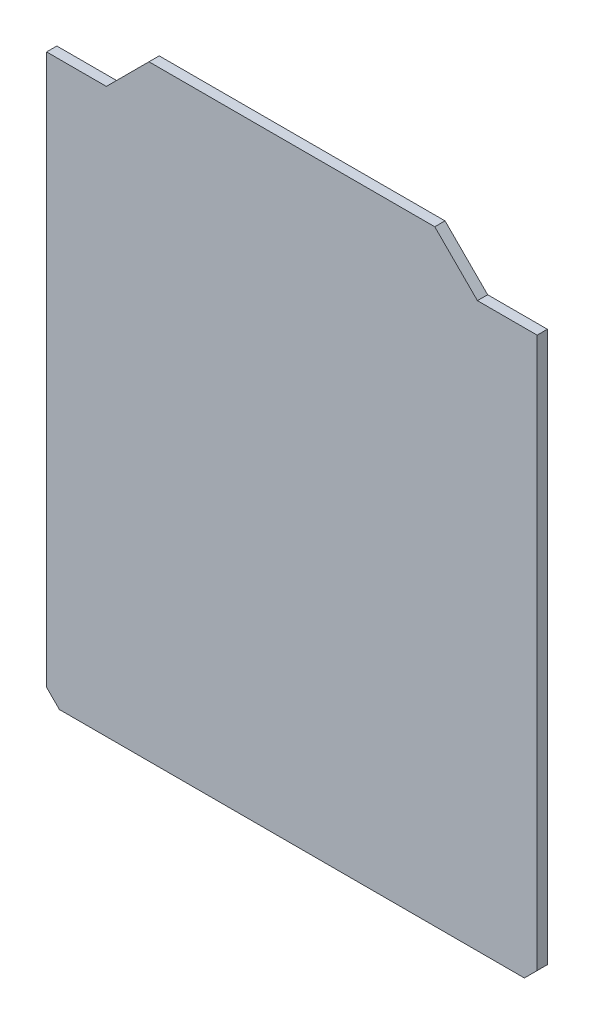
ISO-10303-21;
HEADER;
FILE_DESCRIPTION(('STEP AP214'),'2;1');
FILE_NAME('part.step','',(''),(''),'','','');
FILE_SCHEMA(('AUTOMOTIVE_DESIGN { 1 0 10303 214 1 1 1 1 }'));
ENDSEC;
DATA;
#1=APPLICATION_CONTEXT('core data for automotive mechanical design processes');
#2=APPLICATION_PROTOCOL_DEFINITION('international standard','automotive_design',2000,#1);
#3=PRODUCT_CONTEXT('',#1,'mechanical');
#4=PRODUCT('Part','Part','',(#3));
#5=PRODUCT_RELATED_PRODUCT_CATEGORY('part','',(#4));
#6=PRODUCT_DEFINITION_FORMATION('','',#4);
#7=PRODUCT_DEFINITION_CONTEXT('part definition',#1,'design');
#8=PRODUCT_DEFINITION('design','',#6,#7);
#9=PRODUCT_DEFINITION_SHAPE('','',#8);
#10=(LENGTH_UNIT() NAMED_UNIT(*) SI_UNIT(.MILLI.,.METRE.));
#11=(NAMED_UNIT(*) PLANE_ANGLE_UNIT() SI_UNIT($,.RADIAN.));
#12=(NAMED_UNIT(*) SI_UNIT($,.STERADIAN.) SOLID_ANGLE_UNIT());
#13=UNCERTAINTY_MEASURE_WITH_UNIT(LENGTH_MEASURE(1.E-05),#10,'distance_accuracy_value','');
#14=(GEOMETRIC_REPRESENTATION_CONTEXT(3) GLOBAL_UNCERTAINTY_ASSIGNED_CONTEXT((#13)) GLOBAL_UNIT_ASSIGNED_CONTEXT((#10,
#11,#12)) REPRESENTATION_CONTEXT('',''));
#15=CARTESIAN_POINT('',(0.,0.,0.));
#16=DIRECTION('',(0.,0.,1.));
#17=DIRECTION('',(1.,0.,0.));
#18=AXIS2_PLACEMENT_3D('',#15,#16,#17);
#19=CARTESIAN_POINT('',(29.2004047680435,40.5933845903599,1.2));
#20=DIRECTION('',(-1.,0.,0.));
#21=DIRECTION('',(0.,-1.,0.));
#22=AXIS2_PLACEMENT_3D('',#19,#20,#21);
#23=PLANE('',#22);
#24=DIRECTION('',(0.,1.,0.));
#25=VECTOR('',#24,1.);
#26=CARTESIAN_POINT('',(29.2004047680435,40.5933845903599,1.2));
#27=LINE('',#26,#25);
#28=CARTESIAN_POINT('',(29.2004047680435,-23.914429894717,1.2));
#29=VERTEX_POINT('',#28);
#30=CARTESIAN_POINT('',(29.2004047680435,40.5933845903599,1.2));
#31=VERTEX_POINT('',#30);
#32=EDGE_CURVE('E115',#29,#31,#27,.T.);
#33=ORIENTED_EDGE('',*,*,#32,.F.);
#34=DIRECTION('',(0.,0.,-1.));
#35=VECTOR('',#34,1.);
#36=CARTESIAN_POINT('',(29.2004047680435,-23.914429894717,1.2));
#37=LINE('',#36,#35);
#38=CARTESIAN_POINT('',(29.2004047680435,-23.914429894717,0.));
#39=VERTEX_POINT('',#38);
#40=EDGE_CURVE('E11',#29,#39,#37,.T.);
#41=ORIENTED_EDGE('',*,*,#40,.T.);
#42=DIRECTION('',(0.,1.,0.));
#43=VECTOR('',#42,1.);
#44=CARTESIAN_POINT('',(29.2004047680435,40.5933845903599,0.));
#45=LINE('',#44,#43);
#46=CARTESIAN_POINT('',(29.2004047680435,40.5933845903599,0.));
#47=VERTEX_POINT('',#46);
#48=EDGE_CURVE('E135',#39,#47,#45,.T.);
#49=ORIENTED_EDGE('',*,*,#48,.T.);
#50=DIRECTION('',(0.,0.,-1.));
#51=VECTOR('',#50,1.);
#52=CARTESIAN_POINT('',(29.2004047680435,40.5933845903599,1.2));
#53=LINE('',#52,#51);
#54=EDGE_CURVE('E128',#31,#47,#53,.T.);
#55=ORIENTED_EDGE('',*,*,#54,.F.);
#56=EDGE_LOOP('',(#33,#41,#49,#55));
#57=FACE_BOUND('',#56,.T.);
#58=ADVANCED_FACE('F37',(#57),#23,.F.);
#59=CARTESIAN_POINT('',(22.2004047680435,40.5933845903599,1.2));
#60=DIRECTION('',(0.,-1.,0.));
#61=DIRECTION('',(0.,0.,-1.));
#62=AXIS2_PLACEMENT_3D('',#59,#60,#61);
#63=PLANE('',#62);
#64=DIRECTION('',(-1.,0.,0.));
#65=VECTOR('',#64,1.);
#66=CARTESIAN_POINT('',(22.2004047680435,40.5933845903599,0.));
#67=LINE('',#66,#65);
#68=CARTESIAN_POINT('',(22.2004047680435,40.5933845903599,0.));
#69=VERTEX_POINT('',#68);
#70=EDGE_CURVE('E201',#47,#69,#67,.T.);
#71=ORIENTED_EDGE('',*,*,#70,.T.);
#72=DIRECTION('',(0.,0.,-1.));
#73=VECTOR('',#72,1.);
#74=CARTESIAN_POINT('',(22.2004047680435,40.5933845903599,1.2));
#75=LINE('',#74,#73);
#76=CARTESIAN_POINT('',(22.2004047680435,40.5933845903599,1.2));
#77=VERTEX_POINT('',#76);
#78=EDGE_CURVE('E130',#77,#69,#75,.T.);
#79=ORIENTED_EDGE('',*,*,#78,.F.);
#80=DIRECTION('',(-1.,0.,0.));
#81=VECTOR('',#80,1.);
#82=CARTESIAN_POINT('',(22.2004047680435,40.5933845903599,1.2));
#83=LINE('',#82,#81);
#84=EDGE_CURVE('E118',#31,#77,#83,.T.);
#85=ORIENTED_EDGE('',*,*,#84,.F.);
#86=ORIENTED_EDGE('',*,*,#54,.T.);
#87=EDGE_LOOP('',(#71,#79,#85,#86));
#88=FACE_BOUND('',#87,.T.);
#89=ADVANCED_FACE('F127',(#88),#63,.F.);
#90=CARTESIAN_POINT('',(17.2004047680435,45.5933845903599,1.2));
#91=DIRECTION('',(-0.707106781186546,-0.707106781186549,0.));
#92=DIRECTION('',(0.707106781186549,-0.707106781186546,0.));
#93=AXIS2_PLACEMENT_3D('',#90,#91,#92);
#94=PLANE('',#93);
#95=DIRECTION('',(-0.707106781186549,0.707106781186546,0.));
#96=VECTOR('',#95,1.);
#97=CARTESIAN_POINT('',(17.2004047680435,45.5933845903599,0.));
#98=LINE('',#97,#96);
#99=CARTESIAN_POINT('',(17.2004047680435,45.5933845903599,0.));
#100=VERTEX_POINT('',#99);
#101=EDGE_CURVE('E199',#69,#100,#98,.T.);
#102=ORIENTED_EDGE('',*,*,#101,.T.);
#103=DIRECTION('',(0.,0.,-1.));
#104=VECTOR('',#103,1.);
#105=CARTESIAN_POINT('',(17.2004047680435,45.5933845903599,1.2));
#106=LINE('',#105,#104);
#107=CARTESIAN_POINT('',(17.2004047680435,45.5933845903599,1.2));
#108=VERTEX_POINT('',#107);
#109=EDGE_CURVE('E141',#108,#100,#106,.T.);
#110=ORIENTED_EDGE('',*,*,#109,.F.);
#111=DIRECTION('',(-0.707106781186549,0.707106781186546,0.));
#112=VECTOR('',#111,1.);
#113=CARTESIAN_POINT('',(17.2004047680435,45.5933845903599,1.2));
#114=LINE('',#113,#112);
#115=EDGE_CURVE('E132',#77,#108,#114,.T.);
#116=ORIENTED_EDGE('',*,*,#115,.F.);
#117=ORIENTED_EDGE('',*,*,#78,.T.);
#118=EDGE_LOOP('',(#102,#110,#116,#117));
#119=FACE_BOUND('',#118,.T.);
#120=ADVANCED_FACE('F212',(#119),#94,.F.);
#121=CARTESIAN_POINT('',(17.2004047680435,45.5933845903599,1.2));
#122=DIRECTION('',(0.,-1.,0.));
#123=DIRECTION('',(1.,0.,0.));
#124=AXIS2_PLACEMENT_3D('',#121,#122,#123);
#125=PLANE('',#124);
#126=DIRECTION('',(-1.,0.,0.));
#127=VECTOR('',#126,1.);
#128=CARTESIAN_POINT('',(17.2004047680435,45.5933845903599,0.));
#129=LINE('',#128,#127);
#130=CARTESIAN_POINT('',(-16.2995952319565,45.5933845903599,0.));
#131=VERTEX_POINT('',#130);
#132=EDGE_CURVE('E194',#100,#131,#129,.T.);
#133=ORIENTED_EDGE('',*,*,#132,.T.);
#134=DIRECTION('',(0.,0.,-1.));
#135=VECTOR('',#134,1.);
#136=CARTESIAN_POINT('',(-16.2995952319565,45.5933845903599,1.2));
#137=LINE('',#136,#135);
#138=CARTESIAN_POINT('',(-16.2995952319565,45.5933845903599,1.2));
#139=VERTEX_POINT('',#138);
#140=EDGE_CURVE('E185',#139,#131,#137,.T.);
#141=ORIENTED_EDGE('',*,*,#140,.F.);
#142=DIRECTION('',(-1.,0.,0.));
#143=VECTOR('',#142,1.);
#144=CARTESIAN_POINT('',(17.2004047680435,45.5933845903599,1.2));
#145=LINE('',#144,#143);
#146=EDGE_CURVE('E195',#108,#139,#145,.T.);
#147=ORIENTED_EDGE('',*,*,#146,.F.);
#148=ORIENTED_EDGE('',*,*,#109,.T.);
#149=EDGE_LOOP('',(#133,#141,#147,#148));
#150=FACE_BOUND('',#149,.T.);
#151=ADVANCED_FACE('F192',(#150),#125,.F.);
#152=CARTESIAN_POINT('',(-21.2995952319565,40.5933845903599,1.2));
#153=DIRECTION('',(0.707106781186549,-0.707106781186546,0.));
#154=DIRECTION('',(0.707106781186546,0.707106781186549,0.));
#155=AXIS2_PLACEMENT_3D('',#152,#153,#154);
#156=PLANE('',#155);
#157=DIRECTION('',(-0.707106781186546,-0.707106781186549,0.));
#158=VECTOR('',#157,1.);
#159=CARTESIAN_POINT('',(-21.2995952319565,40.5933845903599,0.));
#160=LINE('',#159,#158);
#161=CARTESIAN_POINT('',(-21.2995952319565,40.5933845903599,0.));
#162=VERTEX_POINT('',#161);
#163=EDGE_CURVE('E177',#131,#162,#160,.T.);
#164=ORIENTED_EDGE('',*,*,#163,.T.);
#165=DIRECTION('',(0.,0.,-1.));
#166=VECTOR('',#165,1.);
#167=CARTESIAN_POINT('',(-21.2995952319565,40.5933845903599,1.2));
#168=LINE('',#167,#166);
#169=CARTESIAN_POINT('',(-21.2995952319565,40.5933845903599,1.2));
#170=VERTEX_POINT('',#169);
#171=EDGE_CURVE('E182',#170,#162,#168,.T.);
#172=ORIENTED_EDGE('',*,*,#171,.F.);
#173=DIRECTION('',(-0.707106781186546,-0.707106781186549,0.));
#174=VECTOR('',#173,1.);
#175=CARTESIAN_POINT('',(-21.2995952319565,40.5933845903599,1.2));
#176=LINE('',#175,#174);
#177=EDGE_CURVE('E209',#139,#170,#176,.T.);
#178=ORIENTED_EDGE('',*,*,#177,.F.);
#179=ORIENTED_EDGE('',*,*,#140,.T.);
#180=EDGE_LOOP('',(#164,#172,#178,#179));
#181=FACE_BOUND('',#180,.T.);
#182=ADVANCED_FACE('F219',(#181),#156,.F.);
#183=CARTESIAN_POINT('',(-28.2995952319565,40.5933845903599,1.2));
#184=DIRECTION('',(0.,-1.,0.));
#185=DIRECTION('',(0.,0.,-1.));
#186=AXIS2_PLACEMENT_3D('',#183,#184,#185);
#187=PLANE('',#186);
#188=DIRECTION('',(-1.,0.,0.));
#189=VECTOR('',#188,1.);
#190=CARTESIAN_POINT('',(-28.2995952319565,40.5933845903599,0.));
#191=LINE('',#190,#189);
#192=CARTESIAN_POINT('',(-28.2995952319565,40.5933845903599,0.));
#193=VERTEX_POINT('',#192);
#194=EDGE_CURVE('E174',#162,#193,#191,.T.);
#195=ORIENTED_EDGE('',*,*,#194,.T.);
#196=DIRECTION('',(0.,0.,-1.));
#197=VECTOR('',#196,1.);
#198=CARTESIAN_POINT('',(-28.2995952319565,40.5933845903599,1.2));
#199=LINE('',#198,#197);
#200=CARTESIAN_POINT('',(-28.2995952319565,40.5933845903599,1.2));
#201=VERTEX_POINT('',#200);
#202=EDGE_CURVE('E163',#201,#193,#199,.T.);
#203=ORIENTED_EDGE('',*,*,#202,.F.);
#204=DIRECTION('',(-1.,0.,0.));
#205=VECTOR('',#204,1.);
#206=CARTESIAN_POINT('',(-28.2995952319565,40.5933845903599,1.2));
#207=LINE('',#206,#205);
#208=EDGE_CURVE('E207',#170,#201,#207,.T.);
#209=ORIENTED_EDGE('',*,*,#208,.F.);
#210=ORIENTED_EDGE('',*,*,#171,.T.);
#211=EDGE_LOOP('',(#195,#203,#209,#210));
#212=FACE_BOUND('',#211,.T.);
#213=ADVANCED_FACE('F245',(#212),#187,.F.);
#214=CARTESIAN_POINT('',(-28.2995952319565,40.5933845903599,1.2));
#215=DIRECTION('',(1.,0.,0.));
#216=DIRECTION('',(0.,1.,0.));
#217=AXIS2_PLACEMENT_3D('',#214,#215,#216);
#218=PLANE('',#217);
#219=DIRECTION('',(0.,-1.,0.));
#220=VECTOR('',#219,1.);
#221=CARTESIAN_POINT('',(-28.2995952319565,40.5933845903599,0.));
#222=LINE('',#221,#220);
#223=CARTESIAN_POINT('',(-28.2995952319565,-23.914429894717,0.));
#224=VERTEX_POINT('',#223);
#225=EDGE_CURVE('E170',#193,#224,#222,.T.);
#226=ORIENTED_EDGE('',*,*,#225,.T.);
#227=DIRECTION('',(0.,0.,1.));
#228=VECTOR('',#227,1.);
#229=CARTESIAN_POINT('',(-28.2995952319565,-23.914429894717,1.2));
#230=LINE('',#229,#228);
#231=CARTESIAN_POINT('',(-28.2995952319565,-23.914429894717,1.2));
#232=VERTEX_POINT('',#231);
#233=EDGE_CURVE('E61',#224,#232,#230,.T.);
#234=ORIENTED_EDGE('',*,*,#233,.T.);
#235=DIRECTION('',(0.,-1.,0.));
#236=VECTOR('',#235,1.);
#237=CARTESIAN_POINT('',(-28.2995952319565,40.5933845903599,1.2));
#238=LINE('',#237,#236);
#239=EDGE_CURVE('E155',#201,#232,#238,.T.);
#240=ORIENTED_EDGE('',*,*,#239,.F.);
#241=ORIENTED_EDGE('',*,*,#202,.T.);
#242=EDGE_LOOP('',(#226,#234,#240,#241));
#243=FACE_BOUND('',#242,.T.);
#244=ADVANCED_FACE('F172',(#243),#218,.F.);
#245=CARTESIAN_POINT('',(-28.2995952319565,-25.414429894717,1.2));
#246=DIRECTION('',(0.,1.,0.));
#247=DIRECTION('',(0.,0.,1.));
#248=AXIS2_PLACEMENT_3D('',#245,#246,#247);
#249=PLANE('',#248);
#250=DIRECTION('',(1.,0.,0.));
#251=VECTOR('',#250,1.);
#252=CARTESIAN_POINT('',(-28.2995952319565,-25.414429894717,1.2));
#253=LINE('',#252,#251);
#254=CARTESIAN_POINT('',(-26.7995952319565,-25.414429894717,1.2));
#255=VERTEX_POINT('',#254);
#256=CARTESIAN_POINT('',(27.7004047680435,-25.414429894717,1.2));
#257=VERTEX_POINT('',#256);
#258=EDGE_CURVE('E154',#255,#257,#253,.T.);
#259=ORIENTED_EDGE('',*,*,#258,.F.);
#260=DIRECTION('',(0.,0.,-1.));
#261=VECTOR('',#260,1.);
#262=CARTESIAN_POINT('',(-26.7995952319565,-25.414429894717,1.2));
#263=LINE('',#262,#261);
#264=CARTESIAN_POINT('',(-26.7995952319565,-25.414429894717,0.));
#265=VERTEX_POINT('',#264);
#266=EDGE_CURVE('E139',#255,#265,#263,.T.);
#267=ORIENTED_EDGE('',*,*,#266,.T.);
#268=DIRECTION('',(1.,0.,0.));
#269=VECTOR('',#268,1.);
#270=CARTESIAN_POINT('',(-28.2995952319565,-25.414429894717,0.));
#271=LINE('',#270,#269);
#272=CARTESIAN_POINT('',(27.7004047680435,-25.414429894717,0.));
#273=VERTEX_POINT('',#272);
#274=EDGE_CURVE('E123',#265,#273,#271,.T.);
#275=ORIENTED_EDGE('',*,*,#274,.T.);
#276=DIRECTION('',(0.,0.,1.));
#277=VECTOR('',#276,1.);
#278=CARTESIAN_POINT('',(27.7004047680435,-25.414429894717,1.2));
#279=LINE('',#278,#277);
#280=EDGE_CURVE('E137',#273,#257,#279,.T.);
#281=ORIENTED_EDGE('',*,*,#280,.T.);
#282=EDGE_LOOP('',(#259,#267,#275,#281));
#283=FACE_BOUND('',#282,.T.);
#284=ADVANCED_FACE('F159',(#283),#249,.F.);
#285=CARTESIAN_POINT('',(0.,0.,1.2));
#286=DIRECTION('',(0.,0.,1.));
#287=DIRECTION('',(1.,0.,0.));
#288=AXIS2_PLACEMENT_3D('',#285,#286,#287);
#289=PLANE('',#288);
#290=ORIENTED_EDGE('',*,*,#239,.T.);
#291=DIRECTION('',(-0.707106781186546,0.707106781186549,0.));
#292=VECTOR('',#291,1.);
#293=CARTESIAN_POINT('',(-26.1070125633368,-26.1070125633367,1.2));
#294=LINE('',#293,#292);
#295=EDGE_CURVE('E46',#232,#255,#294,.F.);
#296=ORIENTED_EDGE('',*,*,#295,.T.);
#297=ORIENTED_EDGE('',*,*,#258,.T.);
#298=DIRECTION('',(-0.707106781186549,-0.707106781186546,0.));
#299=VECTOR('',#298,1.);
#300=CARTESIAN_POINT('',(26.5574173313802,-26.5574173313803,1.2));
#301=LINE('',#300,#299);
#302=EDGE_CURVE('E53',#257,#29,#301,.F.);
#303=ORIENTED_EDGE('',*,*,#302,.T.);
#304=ORIENTED_EDGE('',*,*,#32,.T.);
#305=ORIENTED_EDGE('',*,*,#84,.T.);
#306=ORIENTED_EDGE('',*,*,#115,.T.);
#307=ORIENTED_EDGE('',*,*,#146,.T.);
#308=ORIENTED_EDGE('',*,*,#177,.T.);
#309=ORIENTED_EDGE('',*,*,#208,.T.);
#310=EDGE_LOOP('',(#290,#296,#297,#303,#304,#305,#306,#307,#308,#309));
#311=FACE_BOUND('',#310,.T.);
#312=ADVANCED_FACE('F117',(#311),#289,.T.);
#313=CARTESIAN_POINT('',(0.,0.,0.));
#314=DIRECTION('',(0.,0.,1.));
#315=DIRECTION('',(1.,0.,0.));
#316=AXIS2_PLACEMENT_3D('',#313,#314,#315);
#317=PLANE('',#316);
#318=ORIENTED_EDGE('',*,*,#274,.F.);
#319=DIRECTION('',(0.707106781186546,-0.707106781186549,0.));
#320=VECTOR('',#319,1.);
#321=CARTESIAN_POINT('',(-26.7995952319565,-25.414429894717,0.));
#322=LINE('',#321,#320);
#323=EDGE_CURVE('E149',#265,#224,#322,.F.);
#324=ORIENTED_EDGE('',*,*,#323,.T.);
#325=ORIENTED_EDGE('',*,*,#225,.F.);
#326=ORIENTED_EDGE('',*,*,#194,.F.);
#327=ORIENTED_EDGE('',*,*,#163,.F.);
#328=ORIENTED_EDGE('',*,*,#132,.F.);
#329=ORIENTED_EDGE('',*,*,#101,.F.);
#330=ORIENTED_EDGE('',*,*,#70,.F.);
#331=ORIENTED_EDGE('',*,*,#48,.F.);
#332=DIRECTION('',(0.707106781186549,0.707106781186546,0.));
#333=VECTOR('',#332,1.);
#334=CARTESIAN_POINT('',(29.2004047680435,-23.914429894717,0.));
#335=LINE('',#334,#333);
#336=EDGE_CURVE('E147',#39,#273,#335,.F.);
#337=ORIENTED_EDGE('',*,*,#336,.T.);
#338=EDGE_LOOP('',(#318,#324,#325,#326,#327,#328,#329,#330,#331,#337));
#339=FACE_BOUND('',#338,.T.);
#340=ADVANCED_FACE('F168',(#339),#317,.F.);
#341=CARTESIAN_POINT('',(-26.7995952319565,-25.414429894717,1.2));
#342=DIRECTION('',(0.707106781186549,0.707106781186546,0.));
#343=DIRECTION('',(0.,0.,-1.));
#344=AXIS2_PLACEMENT_3D('',#341,#342,#343);
#345=PLANE('',#344);
#346=ORIENTED_EDGE('',*,*,#295,.F.);
#347=ORIENTED_EDGE('',*,*,#233,.F.);
#348=ORIENTED_EDGE('',*,*,#323,.F.);
#349=ORIENTED_EDGE('',*,*,#266,.F.);
#350=EDGE_LOOP('',(#346,#347,#348,#349));
#351=FACE_BOUND('',#350,.T.);
#352=ADVANCED_FACE('F165',(#351),#345,.F.);
#353=CARTESIAN_POINT('',(29.2004047680435,-23.914429894717,1.2));
#354=DIRECTION('',(-0.707106781186546,0.707106781186549,0.));
#355=DIRECTION('',(0.,0.,-1.));
#356=AXIS2_PLACEMENT_3D('',#353,#354,#355);
#357=PLANE('',#356);
#358=ORIENTED_EDGE('',*,*,#302,.F.);
#359=ORIENTED_EDGE('',*,*,#280,.F.);
#360=ORIENTED_EDGE('',*,*,#336,.F.);
#361=ORIENTED_EDGE('',*,*,#40,.F.);
#362=EDGE_LOOP('',(#358,#359,#360,#361));
#363=FACE_BOUND('',#362,.T.);
#364=ADVANCED_FACE('F40',(#363),#357,.F.);
#365=CLOSED_SHELL('',(#58,#89,#120,#151,#182,#213,#244,#284,#312,#340,#352,#364));
#366=MANIFOLD_SOLID_BREP('B2',#365);
#367=ADVANCED_BREP_SHAPE_REPRESENTATION('',(#18,#366),#14);
#368=SHAPE_DEFINITION_REPRESENTATION(#9,#367);
ENDSEC;
END-ISO-10303-21;
